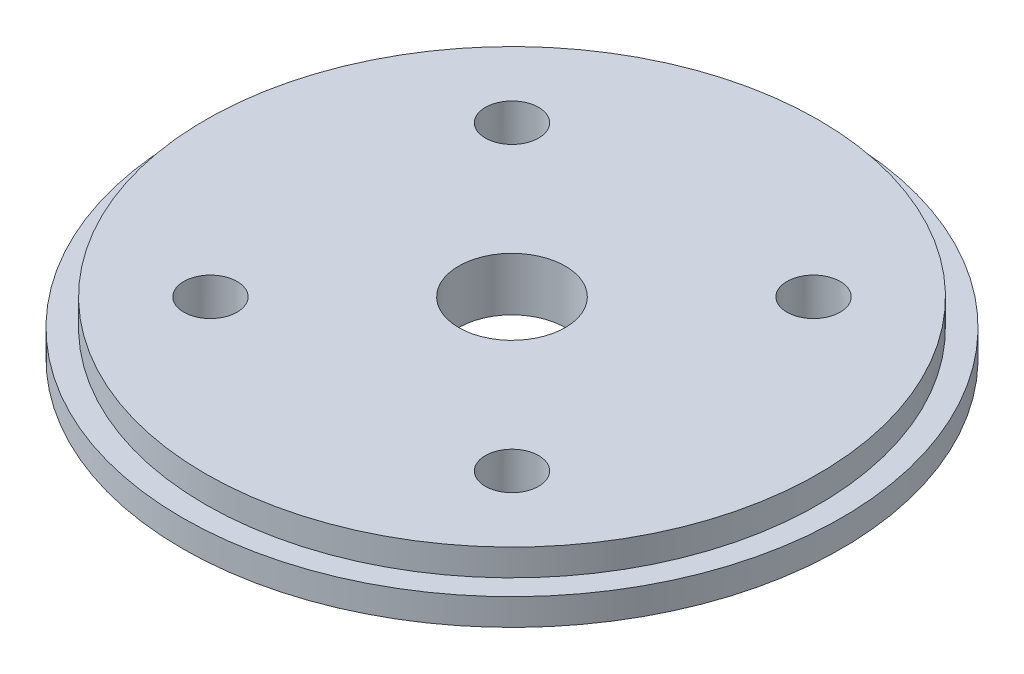
ISO-10303-21;
HEADER;
FILE_DESCRIPTION(('STEP AP214'),'2;1');
FILE_NAME('part.step','',(''),(''),'','','');
FILE_SCHEMA(('AUTOMOTIVE_DESIGN { 1 0 10303 214 1 1 1 1 }'));
ENDSEC;
DATA;
#1=APPLICATION_CONTEXT('core data for automotive mechanical design processes');
#2=APPLICATION_PROTOCOL_DEFINITION('international standard','automotive_design',2000,#1);
#3=PRODUCT_CONTEXT('',#1,'mechanical');
#4=PRODUCT('Part','Part','',(#3));
#5=PRODUCT_RELATED_PRODUCT_CATEGORY('part','',(#4));
#6=PRODUCT_DEFINITION_FORMATION('','',#4);
#7=PRODUCT_DEFINITION_CONTEXT('part definition',#1,'design');
#8=PRODUCT_DEFINITION('design','',#6,#7);
#9=PRODUCT_DEFINITION_SHAPE('','',#8);
#10=(LENGTH_UNIT() NAMED_UNIT(*) SI_UNIT(.MILLI.,.METRE.));
#11=(NAMED_UNIT(*) PLANE_ANGLE_UNIT() SI_UNIT($,.RADIAN.));
#12=(NAMED_UNIT(*) SI_UNIT($,.STERADIAN.) SOLID_ANGLE_UNIT());
#13=UNCERTAINTY_MEASURE_WITH_UNIT(LENGTH_MEASURE(1.E-05),#10,'distance_accuracy_value','');
#14=(GEOMETRIC_REPRESENTATION_CONTEXT(3) GLOBAL_UNCERTAINTY_ASSIGNED_CONTEXT((#13)) GLOBAL_UNIT_ASSIGNED_CONTEXT((#10,
#11,#12)) REPRESENTATION_CONTEXT('',''));
#15=CARTESIAN_POINT('',(0.,0.,0.));
#16=DIRECTION('',(0.,0.,1.));
#17=DIRECTION('',(1.,0.,0.));
#18=AXIS2_PLACEMENT_3D('',#15,#16,#17);
#19=CARTESIAN_POINT('',(-17.9605122421381,6.35,-17.9605122421386));
#20=DIRECTION('',(0.,1.,0.));
#21=DIRECTION('',(0.,0.,1.));
#22=AXIS2_PLACEMENT_3D('',#19,#20,#21);
#23=CYLINDRICAL_SURFACE('',#22,3.175);
#24=CARTESIAN_POINT('',(-17.9605122421381,6.35,-17.9605122421386));
#25=DIRECTION('',(0.,1.,0.));
#26=DIRECTION('',(0.,0.,1.));
#27=AXIS2_PLACEMENT_3D('',#24,#25,#26);
#28=CIRCLE('',#27,3.175);
#29=CARTESIAN_POINT('',(-17.9605122421381,6.35,-14.7855122421386));
#30=VERTEX_POINT('',#29);
#31=EDGE_CURVE('E88',#30,#30,#28,.T.);
#32=ORIENTED_EDGE('',*,*,#31,.T.);
#33=EDGE_LOOP('',(#32));
#34=FACE_BOUND('',#33,.T.);
#35=CARTESIAN_POINT('',(-17.9605122421381,1.5875,-17.9605122421386));
#36=DIRECTION('',(0.,-1.,0.));
#37=DIRECTION('',(0.,0.,-1.));
#38=AXIS2_PLACEMENT_3D('',#35,#36,#37);
#39=CIRCLE('',#38,3.175);
#40=CARTESIAN_POINT('',(-17.9605122421381,1.5875,-21.1355122421386));
#41=VERTEX_POINT('',#40);
#42=EDGE_CURVE('E41',#41,#41,#39,.F.);
#43=ORIENTED_EDGE('',*,*,#42,.F.);
#44=EDGE_LOOP('',(#43));
#45=FACE_BOUND('',#44,.T.);
#46=ADVANCED_FACE('F37',(#34,#45),#23,.F.);
#47=CARTESIAN_POINT('',(17.9605122421384,6.35,17.9605122421382));
#48=DIRECTION('',(0.,1.,0.));
#49=DIRECTION('',(0.,0.,1.));
#50=AXIS2_PLACEMENT_3D('',#47,#48,#49);
#51=CYLINDRICAL_SURFACE('',#50,3.175);
#52=CARTESIAN_POINT('',(17.9605122421384,6.35,17.9605122421382));
#53=DIRECTION('',(0.,1.,0.));
#54=DIRECTION('',(0.,0.,1.));
#55=AXIS2_PLACEMENT_3D('',#52,#53,#54);
#56=CIRCLE('',#55,3.175);
#57=CARTESIAN_POINT('',(17.9605122421384,6.35,21.1355122421382));
#58=VERTEX_POINT('',#57);
#59=EDGE_CURVE('E85',#58,#58,#56,.T.);
#60=ORIENTED_EDGE('',*,*,#59,.T.);
#61=EDGE_LOOP('',(#60));
#62=FACE_BOUND('',#61,.T.);
#63=CARTESIAN_POINT('',(17.9605122421384,1.5875,17.9605122421382));
#64=DIRECTION('',(0.,-1.,0.));
#65=DIRECTION('',(0.,0.,-1.));
#66=AXIS2_PLACEMENT_3D('',#63,#64,#65);
#67=CIRCLE('',#66,3.175);
#68=CARTESIAN_POINT('',(17.9605122421384,1.5875,14.7855122421382));
#69=VERTEX_POINT('',#68);
#70=EDGE_CURVE('E60',#69,#69,#67,.F.);
#71=ORIENTED_EDGE('',*,*,#70,.F.);
#72=EDGE_LOOP('',(#71));
#73=FACE_BOUND('',#72,.T.);
#74=ADVANCED_FACE('F115',(#62,#73),#51,.F.);
#75=CARTESIAN_POINT('',(17.9605122421386,6.35,-17.960512242138));
#76=DIRECTION('',(0.,1.,0.));
#77=DIRECTION('',(0.,0.,1.));
#78=AXIS2_PLACEMENT_3D('',#75,#76,#77);
#79=CYLINDRICAL_SURFACE('',#78,3.175);
#80=CARTESIAN_POINT('',(17.9605122421386,6.35,-17.960512242138));
#81=DIRECTION('',(0.,1.,0.));
#82=DIRECTION('',(0.,0.,1.));
#83=AXIS2_PLACEMENT_3D('',#80,#81,#82);
#84=CIRCLE('',#83,3.175);
#85=CARTESIAN_POINT('',(17.9605122421386,6.35,-14.785512242138));
#86=VERTEX_POINT('',#85);
#87=EDGE_CURVE('E82',#86,#86,#84,.T.);
#88=ORIENTED_EDGE('',*,*,#87,.T.);
#89=EDGE_LOOP('',(#88));
#90=FACE_BOUND('',#89,.T.);
#91=CARTESIAN_POINT('',(17.9605122421386,1.5875,-17.960512242138));
#92=DIRECTION('',(0.,-1.,0.));
#93=DIRECTION('',(0.,0.,-1.));
#94=AXIS2_PLACEMENT_3D('',#91,#92,#93);
#95=CIRCLE('',#94,3.175);
#96=CARTESIAN_POINT('',(17.9605122421386,1.5875,-21.135512242138));
#97=VERTEX_POINT('',#96);
#98=EDGE_CURVE('E57',#97,#97,#95,.F.);
#99=ORIENTED_EDGE('',*,*,#98,.F.);
#100=EDGE_LOOP('',(#99));
#101=FACE_BOUND('',#100,.T.);
#102=ADVANCED_FACE('F121',(#90,#101),#79,.F.);
#103=CARTESIAN_POINT('',(-17.9605122421382,6.35,17.9605122421384));
#104=DIRECTION('',(0.,1.,0.));
#105=DIRECTION('',(0.,0.,1.));
#106=AXIS2_PLACEMENT_3D('',#103,#104,#105);
#107=CYLINDRICAL_SURFACE('',#106,3.175);
#108=CARTESIAN_POINT('',(-17.9605122421382,6.35,17.9605122421384));
#109=DIRECTION('',(0.,1.,0.));
#110=DIRECTION('',(0.,0.,1.));
#111=AXIS2_PLACEMENT_3D('',#108,#109,#110);
#112=CIRCLE('',#111,3.175);
#113=CARTESIAN_POINT('',(-17.9605122421382,6.35,21.1355122421384));
#114=VERTEX_POINT('',#113);
#115=EDGE_CURVE('E74',#114,#114,#112,.T.);
#116=ORIENTED_EDGE('',*,*,#115,.T.);
#117=EDGE_LOOP('',(#116));
#118=FACE_BOUND('',#117,.T.);
#119=CARTESIAN_POINT('',(-17.9605122421382,1.5875,17.9605122421384));
#120=DIRECTION('',(0.,-1.,0.));
#121=DIRECTION('',(0.,0.,-1.));
#122=AXIS2_PLACEMENT_3D('',#119,#120,#121);
#123=CIRCLE('',#122,3.175);
#124=CARTESIAN_POINT('',(-17.9605122421382,1.5875,14.7855122421384));
#125=VERTEX_POINT('',#124);
#126=EDGE_CURVE('E54',#125,#125,#123,.F.);
#127=ORIENTED_EDGE('',*,*,#126,.F.);
#128=EDGE_LOOP('',(#127));
#129=FACE_BOUND('',#128,.T.);
#130=ADVANCED_FACE('F128',(#118,#129),#107,.F.);
#131=CARTESIAN_POINT('',(0.,6.35,0.));
#132=DIRECTION('',(0.,-1.,0.));
#133=DIRECTION('',(0.,0.,-1.));
#134=AXIS2_PLACEMENT_3D('',#131,#132,#133);
#135=CYLINDRICAL_SURFACE('',#134,39.2557);
#136=CARTESIAN_POINT('',(0.,0.,0.));
#137=DIRECTION('',(0.,1.,0.));
#138=DIRECTION('',(0.,0.,1.));
#139=AXIS2_PLACEMENT_3D('',#136,#137,#138);
#140=CIRCLE('',#139,39.2557);
#141=CARTESIAN_POINT('',(0.,0.,39.2557));
#142=VERTEX_POINT('',#141);
#143=EDGE_CURVE('E10',#142,#142,#140,.T.);
#144=ORIENTED_EDGE('',*,*,#143,.T.);
#145=EDGE_LOOP('',(#144));
#146=FACE_BOUND('',#145,.T.);
#147=CARTESIAN_POINT('',(0.,3.175,0.));
#148=DIRECTION('',(0.,1.,0.));
#149=DIRECTION('',(0.,0.,1.));
#150=AXIS2_PLACEMENT_3D('',#147,#148,#149);
#151=CIRCLE('',#150,39.2557);
#152=CARTESIAN_POINT('',(0.,3.175,39.2557));
#153=VERTEX_POINT('',#152);
#154=EDGE_CURVE('E45',#153,#153,#151,.T.);
#155=ORIENTED_EDGE('',*,*,#154,.F.);
#156=EDGE_LOOP('',(#155));
#157=FACE_BOUND('',#156,.T.);
#158=ADVANCED_FACE('F39',(#146,#157),#135,.T.);
#159=CARTESIAN_POINT('',(0.,0.,0.));
#160=DIRECTION('',(0.,1.,0.));
#161=DIRECTION('',(0.,0.,1.));
#162=AXIS2_PLACEMENT_3D('',#159,#160,#161);
#163=PLANE('',#162);
#164=CARTESIAN_POINT('',(-17.9605122421381,0.,-17.9605122421386));
#165=DIRECTION('',(0.,-1.,0.));
#166=DIRECTION('',(0.,0.,-1.));
#167=AXIS2_PLACEMENT_3D('',#164,#165,#166);
#168=CIRCLE('',#167,6.0325);
#169=CARTESIAN_POINT('',(-17.9605122421381,0.,-23.9930122421386));
#170=VERTEX_POINT('',#169);
#171=EDGE_CURVE('E186',#170,#170,#168,.T.);
#172=ORIENTED_EDGE('',*,*,#171,.F.);
#173=EDGE_LOOP('',(#172));
#174=FACE_BOUND('',#173,.T.);
#175=CARTESIAN_POINT('',(17.9605122421386,0.,-17.960512242138));
#176=DIRECTION('',(0.,-1.,0.));
#177=DIRECTION('',(0.,0.,-1.));
#178=AXIS2_PLACEMENT_3D('',#175,#176,#177);
#179=CIRCLE('',#178,6.0325);
#180=CARTESIAN_POINT('',(17.9605122421386,0.,-23.993012242138));
#181=VERTEX_POINT('',#180);
#182=EDGE_CURVE('E178',#181,#181,#179,.T.);
#183=ORIENTED_EDGE('',*,*,#182,.F.);
#184=EDGE_LOOP('',(#183));
#185=FACE_BOUND('',#184,.T.);
#186=CARTESIAN_POINT('',(17.9605122421384,0.,17.9605122421382));
#187=DIRECTION('',(0.,-1.,0.));
#188=DIRECTION('',(0.,0.,-1.));
#189=AXIS2_PLACEMENT_3D('',#186,#187,#188);
#190=CIRCLE('',#189,6.0325);
#191=CARTESIAN_POINT('',(17.9605122421384,0.,11.9280122421382));
#192=VERTEX_POINT('',#191);
#193=EDGE_CURVE('E174',#192,#192,#190,.T.);
#194=ORIENTED_EDGE('',*,*,#193,.F.);
#195=EDGE_LOOP('',(#194));
#196=FACE_BOUND('',#195,.T.);
#197=CARTESIAN_POINT('',(-17.9605122421382,0.,17.9605122421384));
#198=DIRECTION('',(0.,-1.,0.));
#199=DIRECTION('',(0.,0.,-1.));
#200=AXIS2_PLACEMENT_3D('',#197,#198,#199);
#201=CIRCLE('',#200,6.0325);
#202=CARTESIAN_POINT('',(-17.9605122421382,0.,11.9280122421384));
#203=VERTEX_POINT('',#202);
#204=EDGE_CURVE('E77',#203,#203,#201,.T.);
#205=ORIENTED_EDGE('',*,*,#204,.F.);
#206=EDGE_LOOP('',(#205));
#207=FACE_BOUND('',#206,.T.);
#208=CARTESIAN_POINT('',(0.,0.,0.));
#209=DIRECTION('',(0.,1.,0.));
#210=DIRECTION('',(0.,0.,1.));
#211=AXIS2_PLACEMENT_3D('',#208,#209,#210);
#212=CIRCLE('',#211,6.35);
#213=CARTESIAN_POINT('',(0.,0.,6.35));
#214=VERTEX_POINT('',#213);
#215=EDGE_CURVE('E69',#214,#214,#212,.T.);
#216=ORIENTED_EDGE('',*,*,#215,.T.);
#217=EDGE_LOOP('',(#216));
#218=FACE_BOUND('',#217,.T.);
#219=ORIENTED_EDGE('',*,*,#143,.F.);
#220=EDGE_LOOP('',(#219));
#221=FACE_BOUND('',#220,.T.);
#222=ADVANCED_FACE('F110',(#174,#185,#196,#207,#218,#221),#163,.F.);
#223=CARTESIAN_POINT('',(0.,3.175,0.));
#224=DIRECTION('',(0.,1.,0.));
#225=DIRECTION('',(0.,0.,1.));
#226=AXIS2_PLACEMENT_3D('',#223,#224,#225);
#227=PLANE('',#226);
#228=CARTESIAN_POINT('',(0.,3.175,0.));
#229=DIRECTION('',(0.,1.,0.));
#230=DIRECTION('',(0.,0.,1.));
#231=AXIS2_PLACEMENT_3D('',#228,#229,#230);
#232=CIRCLE('',#231,36.5125);
#233=CARTESIAN_POINT('',(0.,3.175,36.5125));
#234=VERTEX_POINT('',#233);
#235=EDGE_CURVE('E50',#234,#234,#232,.T.);
#236=ORIENTED_EDGE('',*,*,#235,.F.);
#237=EDGE_LOOP('',(#236));
#238=FACE_BOUND('',#237,.T.);
#239=ORIENTED_EDGE('',*,*,#154,.T.);
#240=EDGE_LOOP('',(#239));
#241=FACE_BOUND('',#240,.T.);
#242=ADVANCED_FACE('F100',(#238,#241),#227,.T.);
#243=CARTESIAN_POINT('',(0.,3.175,0.));
#244=DIRECTION('',(0.,1.,0.));
#245=DIRECTION('',(0.,0.,1.));
#246=AXIS2_PLACEMENT_3D('',#243,#244,#245);
#247=CYLINDRICAL_SURFACE('',#246,36.5125);
#248=ORIENTED_EDGE('',*,*,#235,.T.);
#249=EDGE_LOOP('',(#248));
#250=FACE_BOUND('',#249,.T.);
#251=CARTESIAN_POINT('',(0.,6.35,0.));
#252=DIRECTION('',(0.,1.,0.));
#253=DIRECTION('',(0.,0.,1.));
#254=AXIS2_PLACEMENT_3D('',#251,#252,#253);
#255=CIRCLE('',#254,36.5125);
#256=CARTESIAN_POINT('',(0.,6.35,36.5125));
#257=VERTEX_POINT('',#256);
#258=EDGE_CURVE('E91',#257,#257,#255,.T.);
#259=ORIENTED_EDGE('',*,*,#258,.F.);
#260=EDGE_LOOP('',(#259));
#261=FACE_BOUND('',#260,.T.);
#262=ADVANCED_FACE('F98',(#250,#261),#247,.T.);
#263=CARTESIAN_POINT('',(0.,6.35,0.));
#264=DIRECTION('',(0.,1.,0.));
#265=DIRECTION('',(0.,0.,1.));
#266=AXIS2_PLACEMENT_3D('',#263,#264,#265);
#267=PLANE('',#266);
#268=CARTESIAN_POINT('',(0.,6.35,0.));
#269=DIRECTION('',(0.,1.,0.));
#270=DIRECTION('',(0.,0.,1.));
#271=AXIS2_PLACEMENT_3D('',#268,#269,#270);
#272=CIRCLE('',#271,6.35);
#273=CARTESIAN_POINT('',(0.,6.35,6.35));
#274=VERTEX_POINT('',#273);
#275=EDGE_CURVE('E65',#274,#274,#272,.T.);
#276=ORIENTED_EDGE('',*,*,#275,.F.);
#277=EDGE_LOOP('',(#276));
#278=FACE_BOUND('',#277,.T.);
#279=ORIENTED_EDGE('',*,*,#115,.F.);
#280=EDGE_LOOP('',(#279));
#281=FACE_BOUND('',#280,.T.);
#282=ORIENTED_EDGE('',*,*,#87,.F.);
#283=EDGE_LOOP('',(#282));
#284=FACE_BOUND('',#283,.T.);
#285=ORIENTED_EDGE('',*,*,#59,.F.);
#286=EDGE_LOOP('',(#285));
#287=FACE_BOUND('',#286,.T.);
#288=ORIENTED_EDGE('',*,*,#31,.F.);
#289=EDGE_LOOP('',(#288));
#290=FACE_BOUND('',#289,.T.);
#291=ORIENTED_EDGE('',*,*,#258,.T.);
#292=EDGE_LOOP('',(#291));
#293=FACE_BOUND('',#292,.T.);
#294=ADVANCED_FACE('F96',(#278,#281,#284,#287,#290,#293),#267,.T.);
#295=CARTESIAN_POINT('',(0.,6.35,0.));
#296=DIRECTION('',(0.,1.,0.));
#297=DIRECTION('',(0.,0.,1.));
#298=AXIS2_PLACEMENT_3D('',#295,#296,#297);
#299=CYLINDRICAL_SURFACE('',#298,6.35);
#300=ORIENTED_EDGE('',*,*,#215,.F.);
#301=EDGE_LOOP('',(#300));
#302=FACE_BOUND('',#301,.T.);
#303=ORIENTED_EDGE('',*,*,#275,.T.);
#304=EDGE_LOOP('',(#303));
#305=FACE_BOUND('',#304,.T.);
#306=ADVANCED_FACE('F107',(#302,#305),#299,.F.);
#307=CARTESIAN_POINT('',(-17.9605122421382,1.5875,17.9605122421384));
#308=DIRECTION('',(0.,-1.,0.));
#309=DIRECTION('',(0.,0.,-1.));
#310=AXIS2_PLACEMENT_3D('',#307,#308,#309);
#311=PLANE('',#310);
#312=CARTESIAN_POINT('',(-17.9605122421382,1.5875,17.9605122421384));
#313=DIRECTION('',(0.,-1.,0.));
#314=DIRECTION('',(0.,0.,-1.));
#315=AXIS2_PLACEMENT_3D('',#312,#313,#314);
#316=CIRCLE('',#315,6.0325);
#317=CARTESIAN_POINT('',(-17.9605122421382,1.5875,11.9280122421384));
#318=VERTEX_POINT('',#317);
#319=EDGE_CURVE('E58',#318,#318,#316,.T.);
#320=ORIENTED_EDGE('',*,*,#319,.T.);
#321=EDGE_LOOP('',(#320));
#322=FACE_BOUND('',#321,.T.);
#323=ORIENTED_EDGE('',*,*,#126,.T.);
#324=EDGE_LOOP('',(#323));
#325=FACE_BOUND('',#324,.T.);
#326=ADVANCED_FACE('F134',(#322,#325),#311,.T.);
#327=CARTESIAN_POINT('',(-17.9605122421382,1.5875,17.9605122421384));
#328=DIRECTION('',(0.,-1.,0.));
#329=DIRECTION('',(0.,0.,-1.));
#330=AXIS2_PLACEMENT_3D('',#327,#328,#329);
#331=CYLINDRICAL_SURFACE('',#330,6.0325);
#332=ORIENTED_EDGE('',*,*,#319,.F.);
#333=EDGE_LOOP('',(#332));
#334=FACE_BOUND('',#333,.T.);
#335=ORIENTED_EDGE('',*,*,#204,.T.);
#336=EDGE_LOOP('',(#335));
#337=FACE_BOUND('',#336,.T.);
#338=ADVANCED_FACE('F136',(#334,#337),#331,.F.);
#339=CARTESIAN_POINT('',(17.9605122421386,1.5875,-17.960512242138));
#340=DIRECTION('',(0.,-1.,0.));
#341=DIRECTION('',(0.,0.,-1.));
#342=AXIS2_PLACEMENT_3D('',#339,#340,#341);
#343=PLANE('',#342);
#344=CARTESIAN_POINT('',(17.9605122421386,1.5875,-17.960512242138));
#345=DIRECTION('',(0.,-1.,0.));
#346=DIRECTION('',(0.,0.,-1.));
#347=AXIS2_PLACEMENT_3D('',#344,#345,#346);
#348=CIRCLE('',#347,6.0325);
#349=CARTESIAN_POINT('',(17.9605122421386,1.5875,-23.993012242138));
#350=VERTEX_POINT('',#349);
#351=EDGE_CURVE('E183',#350,#350,#348,.T.);
#352=ORIENTED_EDGE('',*,*,#351,.T.);
#353=EDGE_LOOP('',(#352));
#354=FACE_BOUND('',#353,.T.);
#355=ORIENTED_EDGE('',*,*,#98,.T.);
#356=EDGE_LOOP('',(#355));
#357=FACE_BOUND('',#356,.T.);
#358=ADVANCED_FACE('F139',(#354,#357),#343,.T.);
#359=CARTESIAN_POINT('',(17.9605122421386,1.5875,-17.960512242138));
#360=DIRECTION('',(0.,-1.,0.));
#361=DIRECTION('',(0.,0.,-1.));
#362=AXIS2_PLACEMENT_3D('',#359,#360,#361);
#363=CYLINDRICAL_SURFACE('',#362,6.0325);
#364=ORIENTED_EDGE('',*,*,#351,.F.);
#365=EDGE_LOOP('',(#364));
#366=FACE_BOUND('',#365,.T.);
#367=ORIENTED_EDGE('',*,*,#182,.T.);
#368=EDGE_LOOP('',(#367));
#369=FACE_BOUND('',#368,.T.);
#370=ADVANCED_FACE('F155',(#366,#369),#363,.F.);
#371=CARTESIAN_POINT('',(17.9605122421384,1.5875,17.9605122421382));
#372=DIRECTION('',(0.,-1.,0.));
#373=DIRECTION('',(0.,0.,-1.));
#374=AXIS2_PLACEMENT_3D('',#371,#372,#373);
#375=PLANE('',#374);
#376=CARTESIAN_POINT('',(17.9605122421384,1.5875,17.9605122421382));
#377=DIRECTION('',(0.,-1.,0.));
#378=DIRECTION('',(0.,0.,-1.));
#379=AXIS2_PLACEMENT_3D('',#376,#377,#378);
#380=CIRCLE('',#379,6.0325);
#381=CARTESIAN_POINT('',(17.9605122421384,1.5875,11.9280122421382));
#382=VERTEX_POINT('',#381);
#383=EDGE_CURVE('E171',#382,#382,#380,.T.);
#384=ORIENTED_EDGE('',*,*,#383,.T.);
#385=EDGE_LOOP('',(#384));
#386=FACE_BOUND('',#385,.T.);
#387=ORIENTED_EDGE('',*,*,#70,.T.);
#388=EDGE_LOOP('',(#387));
#389=FACE_BOUND('',#388,.T.);
#390=ADVANCED_FACE('F159',(#386,#389),#375,.T.);
#391=CARTESIAN_POINT('',(17.9605122421384,1.5875,17.9605122421382));
#392=DIRECTION('',(0.,-1.,0.));
#393=DIRECTION('',(0.,0.,-1.));
#394=AXIS2_PLACEMENT_3D('',#391,#392,#393);
#395=CYLINDRICAL_SURFACE('',#394,6.0325);
#396=ORIENTED_EDGE('',*,*,#383,.F.);
#397=EDGE_LOOP('',(#396));
#398=FACE_BOUND('',#397,.T.);
#399=ORIENTED_EDGE('',*,*,#193,.T.);
#400=EDGE_LOOP('',(#399));
#401=FACE_BOUND('',#400,.T.);
#402=ADVANCED_FACE('F148',(#398,#401),#395,.F.);
#403=CARTESIAN_POINT('',(-17.9605122421381,1.5875,-17.9605122421386));
#404=DIRECTION('',(0.,-1.,0.));
#405=DIRECTION('',(0.,0.,-1.));
#406=AXIS2_PLACEMENT_3D('',#403,#404,#405);
#407=PLANE('',#406);
#408=CARTESIAN_POINT('',(-17.9605122421381,1.5875,-17.9605122421386));
#409=DIRECTION('',(0.,-1.,0.));
#410=DIRECTION('',(0.,0.,-1.));
#411=AXIS2_PLACEMENT_3D('',#408,#409,#410);
#412=CIRCLE('',#411,6.0325);
#413=CARTESIAN_POINT('',(-17.9605122421381,1.5875,-23.9930122421386));
#414=VERTEX_POINT('',#413);
#415=EDGE_CURVE('E189',#414,#414,#412,.T.);
#416=ORIENTED_EDGE('',*,*,#415,.T.);
#417=EDGE_LOOP('',(#416));
#418=FACE_BOUND('',#417,.T.);
#419=ORIENTED_EDGE('',*,*,#42,.T.);
#420=EDGE_LOOP('',(#419));
#421=FACE_BOUND('',#420,.T.);
#422=ADVANCED_FACE('F144',(#418,#421),#407,.T.);
#423=CARTESIAN_POINT('',(-17.9605122421381,1.5875,-17.9605122421386));
#424=DIRECTION('',(0.,-1.,0.));
#425=DIRECTION('',(0.,0.,-1.));
#426=AXIS2_PLACEMENT_3D('',#423,#424,#425);
#427=CYLINDRICAL_SURFACE('',#426,6.0325);
#428=ORIENTED_EDGE('',*,*,#415,.F.);
#429=EDGE_LOOP('',(#428));
#430=FACE_BOUND('',#429,.T.);
#431=ORIENTED_EDGE('',*,*,#171,.T.);
#432=EDGE_LOOP('',(#431));
#433=FACE_BOUND('',#432,.T.);
#434=ADVANCED_FACE('F147',(#430,#433),#427,.F.);
#435=CLOSED_SHELL('',(#46,#74,#102,#130,#158,#222,#242,#262,#294,#306,#326,#338,#358,#370,#390,
#402,#422,#434));
#436=MANIFOLD_SOLID_BREP('B2',#435);
#437=ADVANCED_BREP_SHAPE_REPRESENTATION('',(#18,#436),#14);
#438=SHAPE_DEFINITION_REPRESENTATION(#9,#437);
ENDSEC;
END-ISO-10303-21;
